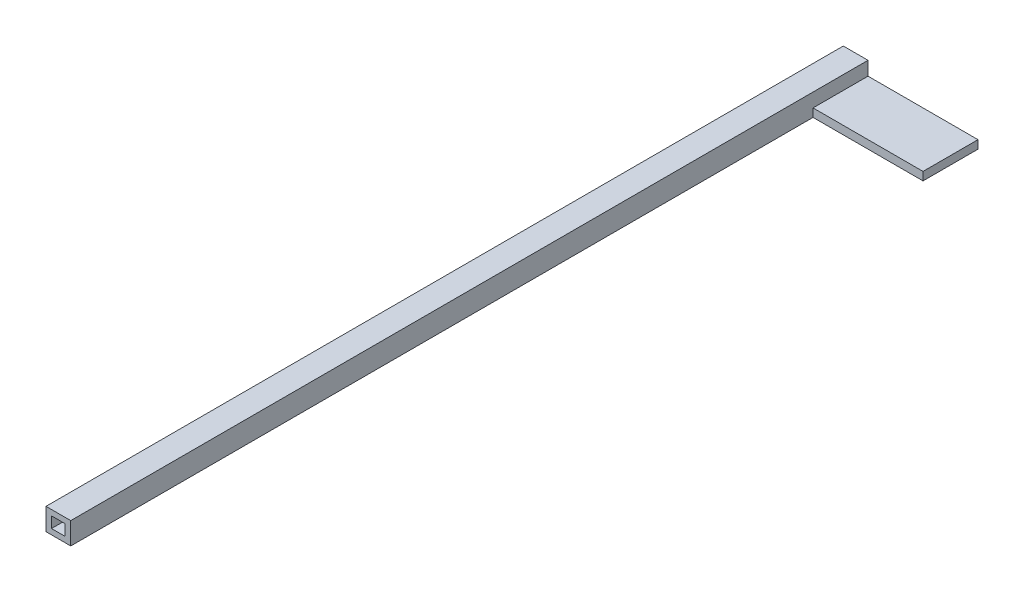
ISO-10303-21;
HEADER;
FILE_DESCRIPTION(('STEP AP214'),'2;1');
FILE_NAME('part.step','',(''),(''),'','','');
FILE_SCHEMA(('AUTOMOTIVE_DESIGN { 1 0 10303 214 1 1 1 1 }'));
ENDSEC;
DATA;
#1=APPLICATION_CONTEXT('core data for automotive mechanical design processes');
#2=APPLICATION_PROTOCOL_DEFINITION('international standard','automotive_design',2000,#1);
#3=PRODUCT_CONTEXT('',#1,'mechanical');
#4=PRODUCT('Part','Part','',(#3));
#5=PRODUCT_RELATED_PRODUCT_CATEGORY('part','',(#4));
#6=PRODUCT_DEFINITION_FORMATION('','',#4);
#7=PRODUCT_DEFINITION_CONTEXT('part definition',#1,'design');
#8=PRODUCT_DEFINITION('design','',#6,#7);
#9=PRODUCT_DEFINITION_SHAPE('','',#8);
#10=(LENGTH_UNIT() NAMED_UNIT(*) SI_UNIT(.MILLI.,.METRE.));
#11=(NAMED_UNIT(*) PLANE_ANGLE_UNIT() SI_UNIT($,.RADIAN.));
#12=(NAMED_UNIT(*) SI_UNIT($,.STERADIAN.) SOLID_ANGLE_UNIT());
#13=UNCERTAINTY_MEASURE_WITH_UNIT(LENGTH_MEASURE(1.E-05),#10,'distance_accuracy_value','');
#14=(GEOMETRIC_REPRESENTATION_CONTEXT(3) GLOBAL_UNCERTAINTY_ASSIGNED_CONTEXT((#13)) GLOBAL_UNIT_ASSIGNED_CONTEXT((#10,
#11,#12)) REPRESENTATION_CONTEXT('',''));
#15=CARTESIAN_POINT('',(0.,0.,0.));
#16=DIRECTION('',(0.,0.,1.));
#17=DIRECTION('',(1.,0.,0.));
#18=AXIS2_PLACEMENT_3D('',#15,#16,#17);
#19=CARTESIAN_POINT('',(0.,0.,290.));
#20=DIRECTION('',(0.,0.,1.));
#21=DIRECTION('',(1.,0.,0.));
#22=AXIS2_PLACEMENT_3D('',#19,#20,#21);
#23=PLANE('',#22);
#24=DIRECTION('',(0.,-1.,0.));
#25=VECTOR('',#24,1.);
#26=CARTESIAN_POINT('',(-4.5,-4.,290.));
#27=LINE('',#26,#25);
#28=CARTESIAN_POINT('',(-4.5,4.,290.));
#29=VERTEX_POINT('',#28);
#30=CARTESIAN_POINT('',(-4.5,-4.,290.));
#31=VERTEX_POINT('',#30);
#32=EDGE_CURVE('E168',#29,#31,#27,.T.);
#33=ORIENTED_EDGE('',*,*,#32,.T.);
#34=DIRECTION('',(1.,0.,0.));
#35=VECTOR('',#34,1.);
#36=CARTESIAN_POINT('',(4.5,-4.,290.));
#37=LINE('',#36,#35);
#38=CARTESIAN_POINT('',(4.5,-4.,290.));
#39=VERTEX_POINT('',#38);
#40=EDGE_CURVE('E171',#31,#39,#37,.T.);
#41=ORIENTED_EDGE('',*,*,#40,.T.);
#42=DIRECTION('',(0.,1.,0.));
#43=VECTOR('',#42,1.);
#44=CARTESIAN_POINT('',(4.5,-4.,290.));
#45=LINE('',#44,#43);
#46=CARTESIAN_POINT('',(4.5,4.,290.));
#47=VERTEX_POINT('',#46);
#48=EDGE_CURVE('E174',#39,#47,#45,.T.);
#49=ORIENTED_EDGE('',*,*,#48,.T.);
#50=DIRECTION('',(-1.,0.,0.));
#51=VECTOR('',#50,1.);
#52=CARTESIAN_POINT('',(4.5,4.,290.));
#53=LINE('',#52,#51);
#54=EDGE_CURVE('E176',#47,#29,#53,.T.);
#55=ORIENTED_EDGE('',*,*,#54,.T.);
#56=EDGE_LOOP('',(#33,#41,#49,#55));
#57=FACE_BOUND('',#56,.T.);
#58=DIRECTION('',(1.,0.,0.));
#59=VECTOR('',#58,1.);
#60=CARTESIAN_POINT('',(-2.5,-2.,290.));
#61=LINE('',#60,#59);
#62=CARTESIAN_POINT('',(-2.5,-2.,290.));
#63=VERTEX_POINT('',#62);
#64=CARTESIAN_POINT('',(2.5,-2.,290.));
#65=VERTEX_POINT('',#64);
#66=EDGE_CURVE('E132',#63,#65,#61,.T.);
#67=ORIENTED_EDGE('',*,*,#66,.F.);
#68=DIRECTION('',(0.,1.,0.));
#69=VECTOR('',#68,1.);
#70=CARTESIAN_POINT('',(-2.5,-2.,290.));
#71=LINE('',#70,#69);
#72=CARTESIAN_POINT('',(-2.5,2.,290.));
#73=VERTEX_POINT('',#72);
#74=EDGE_CURVE('E48',#63,#73,#71,.T.);
#75=ORIENTED_EDGE('',*,*,#74,.T.);
#76=DIRECTION('',(1.,0.,0.));
#77=VECTOR('',#76,1.);
#78=CARTESIAN_POINT('',(-2.5,2.,290.));
#79=LINE('',#78,#77);
#80=CARTESIAN_POINT('',(2.5,2.,290.));
#81=VERTEX_POINT('',#80);
#82=EDGE_CURVE('E136',#73,#81,#79,.T.);
#83=ORIENTED_EDGE('',*,*,#82,.T.);
#84=DIRECTION('',(0.,1.,0.));
#85=VECTOR('',#84,1.);
#86=CARTESIAN_POINT('',(2.5,-2.,290.));
#87=LINE('',#86,#85);
#88=EDGE_CURVE('E317',#65,#81,#87,.T.);
#89=ORIENTED_EDGE('',*,*,#88,.F.);
#90=EDGE_LOOP('',(#67,#75,#83,#89));
#91=FACE_BOUND('',#90,.T.);
#92=ADVANCED_FACE('F33',(#57,#91),#23,.T.);
#93=CARTESIAN_POINT('',(4.5,-4.,290.));
#94=DIRECTION('',(-1.,0.,0.));
#95=DIRECTION('',(0.,0.,1.));
#96=AXIS2_PLACEMENT_3D('',#93,#94,#95);
#97=PLANE('',#96);
#98=DIRECTION('',(0.,-1.,0.));
#99=VECTOR('',#98,1.);
#100=CARTESIAN_POINT('',(4.5,-4.,20.));
#101=LINE('',#100,#99);
#102=CARTESIAN_POINT('',(4.5,-1.,20.));
#103=VERTEX_POINT('',#102);
#104=CARTESIAN_POINT('',(4.5,-4.,20.));
#105=VERTEX_POINT('',#104);
#106=EDGE_CURVE('E141',#103,#105,#101,.T.);
#107=ORIENTED_EDGE('',*,*,#106,.F.);
#108=DIRECTION('',(0.,0.,1.));
#109=VECTOR('',#108,1.);
#110=CARTESIAN_POINT('',(4.5,-1.,0.));
#111=LINE('',#110,#109);
#112=CARTESIAN_POINT('',(4.5,-1.,0.));
#113=VERTEX_POINT('',#112);
#114=EDGE_CURVE('E137',#113,#103,#111,.T.);
#115=ORIENTED_EDGE('',*,*,#114,.F.);
#116=DIRECTION('',(0.,1.,0.));
#117=VECTOR('',#116,1.);
#118=CARTESIAN_POINT('',(4.5,-4.,0.));
#119=LINE('',#118,#117);
#120=CARTESIAN_POINT('',(4.5,4.,0.));
#121=VERTEX_POINT('',#120);
#122=EDGE_CURVE('E183',#113,#121,#119,.T.);
#123=ORIENTED_EDGE('',*,*,#122,.T.);
#124=DIRECTION('',(0.,0.,-1.));
#125=VECTOR('',#124,1.);
#126=CARTESIAN_POINT('',(4.5,4.,290.));
#127=LINE('',#126,#125);
#128=EDGE_CURVE('E188',#47,#121,#127,.T.);
#129=ORIENTED_EDGE('',*,*,#128,.F.);
#130=ORIENTED_EDGE('',*,*,#48,.F.);
#131=DIRECTION('',(0.,0.,-1.));
#132=VECTOR('',#131,1.);
#133=CARTESIAN_POINT('',(4.5,-4.,290.));
#134=LINE('',#133,#132);
#135=EDGE_CURVE('E41',#39,#105,#134,.T.);
#136=ORIENTED_EDGE('',*,*,#135,.T.);
#137=EDGE_LOOP('',(#107,#115,#123,#129,#130,#136));
#138=FACE_BOUND('',#137,.T.);
#139=ADVANCED_FACE('F207',(#138),#97,.F.);
#140=CARTESIAN_POINT('',(-4.5,-4.,290.));
#141=DIRECTION('',(1.,0.,0.));
#142=DIRECTION('',(0.,0.,-1.));
#143=AXIS2_PLACEMENT_3D('',#140,#141,#142);
#144=PLANE('',#143);
#145=DIRECTION('',(0.,-1.,0.));
#146=VECTOR('',#145,1.);
#147=CARTESIAN_POINT('',(-4.5,-4.,0.));
#148=LINE('',#147,#146);
#149=CARTESIAN_POINT('',(-4.5,4.,0.));
#150=VERTEX_POINT('',#149);
#151=CARTESIAN_POINT('',(-4.5,-4.,0.));
#152=VERTEX_POINT('',#151);
#153=EDGE_CURVE('E167',#150,#152,#148,.T.);
#154=ORIENTED_EDGE('',*,*,#153,.T.);
#155=DIRECTION('',(0.,0.,-1.));
#156=VECTOR('',#155,1.);
#157=CARTESIAN_POINT('',(-4.5,-4.,290.));
#158=LINE('',#157,#156);
#159=EDGE_CURVE('E11',#31,#152,#158,.T.);
#160=ORIENTED_EDGE('',*,*,#159,.F.);
#161=ORIENTED_EDGE('',*,*,#32,.F.);
#162=DIRECTION('',(0.,0.,-1.));
#163=VECTOR('',#162,1.);
#164=CARTESIAN_POINT('',(-4.5,4.,290.));
#165=LINE('',#164,#163);
#166=EDGE_CURVE('E178',#29,#150,#165,.T.);
#167=ORIENTED_EDGE('',*,*,#166,.T.);
#168=EDGE_LOOP('',(#154,#160,#161,#167));
#169=FACE_BOUND('',#168,.T.);
#170=ADVANCED_FACE('F35',(#169),#144,.F.);
#171=CARTESIAN_POINT('',(4.5,-4.,290.));
#172=DIRECTION('',(0.,1.,0.));
#173=DIRECTION('',(-1.,0.,0.));
#174=AXIS2_PLACEMENT_3D('',#171,#172,#173);
#175=PLANE('',#174);
#176=DIRECTION('',(1.,0.,0.));
#177=VECTOR('',#176,1.);
#178=CARTESIAN_POINT('',(4.5,-4.,0.));
#179=LINE('',#178,#177);
#180=CARTESIAN_POINT('',(44.5,-4.,0.));
#181=VERTEX_POINT('',#180);
#182=EDGE_CURVE('E181',#152,#181,#179,.T.);
#183=ORIENTED_EDGE('',*,*,#182,.T.);
#184=DIRECTION('',(0.,0.,-1.));
#185=VECTOR('',#184,1.);
#186=CARTESIAN_POINT('',(44.5,-4.,0.));
#187=LINE('',#186,#185);
#188=CARTESIAN_POINT('',(44.5,-4.,20.));
#189=VERTEX_POINT('',#188);
#190=EDGE_CURVE('E154',#189,#181,#187,.T.);
#191=ORIENTED_EDGE('',*,*,#190,.F.);
#192=DIRECTION('',(-1.,0.,0.));
#193=VECTOR('',#192,1.);
#194=CARTESIAN_POINT('',(44.5,-4.,20.));
#195=LINE('',#194,#193);
#196=EDGE_CURVE('E156',#189,#105,#195,.T.);
#197=ORIENTED_EDGE('',*,*,#196,.T.);
#198=ORIENTED_EDGE('',*,*,#135,.F.);
#199=ORIENTED_EDGE('',*,*,#40,.F.);
#200=ORIENTED_EDGE('',*,*,#159,.T.);
#201=EDGE_LOOP('',(#183,#191,#197,#198,#199,#200));
#202=FACE_BOUND('',#201,.T.);
#203=ADVANCED_FACE('F214',(#202),#175,.F.);
#204=CARTESIAN_POINT('',(4.5,4.,290.));
#205=DIRECTION('',(0.,-1.,0.));
#206=DIRECTION('',(1.,0.,0.));
#207=AXIS2_PLACEMENT_3D('',#204,#205,#206);
#208=PLANE('',#207);
#209=DIRECTION('',(-1.,0.,0.));
#210=VECTOR('',#209,1.);
#211=CARTESIAN_POINT('',(4.5,4.,0.));
#212=LINE('',#211,#210);
#213=EDGE_CURVE('E172',#121,#150,#212,.T.);
#214=ORIENTED_EDGE('',*,*,#213,.T.);
#215=ORIENTED_EDGE('',*,*,#166,.F.);
#216=ORIENTED_EDGE('',*,*,#54,.F.);
#217=ORIENTED_EDGE('',*,*,#128,.T.);
#218=EDGE_LOOP('',(#214,#215,#216,#217));
#219=FACE_BOUND('',#218,.T.);
#220=ADVANCED_FACE('F194',(#219),#208,.F.);
#221=CARTESIAN_POINT('',(0.,0.,0.));
#222=DIRECTION('',(0.,0.,1.));
#223=DIRECTION('',(1.,0.,0.));
#224=AXIS2_PLACEMENT_3D('',#221,#222,#223);
#225=PLANE('',#224);
#226=ORIENTED_EDGE('',*,*,#153,.F.);
#227=ORIENTED_EDGE('',*,*,#213,.F.);
#228=ORIENTED_EDGE('',*,*,#122,.F.);
#229=DIRECTION('',(-1.,0.,0.));
#230=VECTOR('',#229,1.);
#231=CARTESIAN_POINT('',(44.5,-0.999999999999997,0.));
#232=LINE('',#231,#230);
#233=CARTESIAN_POINT('',(44.5,-0.999999999999997,0.));
#234=VERTEX_POINT('',#233);
#235=EDGE_CURVE('E164',#234,#113,#232,.T.);
#236=ORIENTED_EDGE('',*,*,#235,.F.);
#237=DIRECTION('',(0.,1.,0.));
#238=VECTOR('',#237,1.);
#239=CARTESIAN_POINT('',(44.5,-4.,0.));
#240=LINE('',#239,#238);
#241=EDGE_CURVE('E147',#181,#234,#240,.T.);
#242=ORIENTED_EDGE('',*,*,#241,.F.);
#243=ORIENTED_EDGE('',*,*,#182,.F.);
#244=EDGE_LOOP('',(#226,#227,#228,#236,#242,#243));
#245=FACE_BOUND('',#244,.T.);
#246=ADVANCED_FACE('F199',(#245),#225,.F.);
#247=CARTESIAN_POINT('',(44.5,-0.999999999999997,0.));
#248=DIRECTION('',(0.,-1.,0.));
#249=DIRECTION('',(0.,0.,-1.));
#250=AXIS2_PLACEMENT_3D('',#247,#248,#249);
#251=PLANE('',#250);
#252=ORIENTED_EDGE('',*,*,#114,.T.);
#253=DIRECTION('',(-1.,0.,0.));
#254=VECTOR('',#253,1.);
#255=CARTESIAN_POINT('',(44.5,-0.999999999999999,20.));
#256=LINE('',#255,#254);
#257=CARTESIAN_POINT('',(44.5,-0.999999999999999,20.));
#258=VERTEX_POINT('',#257);
#259=EDGE_CURVE('E161',#258,#103,#256,.T.);
#260=ORIENTED_EDGE('',*,*,#259,.F.);
#261=DIRECTION('',(0.,0.,1.));
#262=VECTOR('',#261,1.);
#263=CARTESIAN_POINT('',(44.5,-0.999999999999997,0.));
#264=LINE('',#263,#262);
#265=EDGE_CURVE('E150',#234,#258,#264,.T.);
#266=ORIENTED_EDGE('',*,*,#265,.F.);
#267=ORIENTED_EDGE('',*,*,#235,.T.);
#268=EDGE_LOOP('',(#252,#260,#266,#267));
#269=FACE_BOUND('',#268,.T.);
#270=ADVANCED_FACE('F229',(#269),#251,.F.);
#271=CARTESIAN_POINT('',(44.5,-4.,20.));
#272=DIRECTION('',(0.,0.,-1.));
#273=DIRECTION('',(-1.,0.,0.));
#274=AXIS2_PLACEMENT_3D('',#271,#272,#273);
#275=PLANE('',#274);
#276=ORIENTED_EDGE('',*,*,#106,.T.);
#277=ORIENTED_EDGE('',*,*,#196,.F.);
#278=DIRECTION('',(0.,-1.,0.));
#279=VECTOR('',#278,1.);
#280=CARTESIAN_POINT('',(44.5,-4.,20.));
#281=LINE('',#280,#279);
#282=EDGE_CURVE('E152',#258,#189,#281,.T.);
#283=ORIENTED_EDGE('',*,*,#282,.F.);
#284=ORIENTED_EDGE('',*,*,#259,.T.);
#285=EDGE_LOOP('',(#276,#277,#283,#284));
#286=FACE_BOUND('',#285,.T.);
#287=ADVANCED_FACE('F232',(#286),#275,.F.);
#288=CARTESIAN_POINT('',(44.5,0.,0.));
#289=DIRECTION('',(1.,0.,0.));
#290=DIRECTION('',(0.,0.,-1.));
#291=AXIS2_PLACEMENT_3D('',#288,#289,#290);
#292=PLANE('',#291);
#293=ORIENTED_EDGE('',*,*,#241,.T.);
#294=ORIENTED_EDGE('',*,*,#265,.T.);
#295=ORIENTED_EDGE('',*,*,#282,.T.);
#296=ORIENTED_EDGE('',*,*,#190,.T.);
#297=EDGE_LOOP('',(#293,#294,#295,#296));
#298=FACE_BOUND('',#297,.T.);
#299=ADVANCED_FACE('F225',(#298),#292,.T.);
#300=CARTESIAN_POINT('',(-2.5,-2.,270.));
#301=DIRECTION('',(1.,0.,0.));
#302=DIRECTION('',(0.,1.,0.));
#303=AXIS2_PLACEMENT_3D('',#300,#301,#302);
#304=PLANE('',#303);
#305=ORIENTED_EDGE('',*,*,#74,.F.);
#306=DIRECTION('',(0.,0.,1.));
#307=VECTOR('',#306,1.);
#308=CARTESIAN_POINT('',(-2.5,-2.,270.));
#309=LINE('',#308,#307);
#310=CARTESIAN_POINT('',(-2.5,-2.,270.));
#311=VERTEX_POINT('',#310);
#312=EDGE_CURVE('E131',#311,#63,#309,.T.);
#313=ORIENTED_EDGE('',*,*,#312,.F.);
#314=DIRECTION('',(0.,1.,0.));
#315=VECTOR('',#314,1.);
#316=CARTESIAN_POINT('',(-2.5,-2.,270.));
#317=LINE('',#316,#315);
#318=CARTESIAN_POINT('',(-2.5,2.,270.));
#319=VERTEX_POINT('',#318);
#320=EDGE_CURVE('E121',#311,#319,#317,.T.);
#321=ORIENTED_EDGE('',*,*,#320,.T.);
#322=DIRECTION('',(0.,0.,1.));
#323=VECTOR('',#322,1.);
#324=CARTESIAN_POINT('',(-2.5,2.,270.));
#325=LINE('',#324,#323);
#326=EDGE_CURVE('E130',#319,#73,#325,.T.);
#327=ORIENTED_EDGE('',*,*,#326,.T.);
#328=EDGE_LOOP('',(#305,#313,#321,#327));
#329=FACE_BOUND('',#328,.T.);
#330=ADVANCED_FACE('F129',(#329),#304,.T.);
#331=CARTESIAN_POINT('',(-2.5,2.,270.));
#332=DIRECTION('',(0.,-1.,0.));
#333=DIRECTION('',(0.,0.,-1.));
#334=AXIS2_PLACEMENT_3D('',#331,#332,#333);
#335=PLANE('',#334);
#336=ORIENTED_EDGE('',*,*,#82,.F.);
#337=ORIENTED_EDGE('',*,*,#326,.F.);
#338=DIRECTION('',(1.,0.,0.));
#339=VECTOR('',#338,1.);
#340=CARTESIAN_POINT('',(-2.5,2.,270.));
#341=LINE('',#340,#339);
#342=CARTESIAN_POINT('',(2.5,2.,270.));
#343=VERTEX_POINT('',#342);
#344=EDGE_CURVE('E117',#319,#343,#341,.T.);
#345=ORIENTED_EDGE('',*,*,#344,.T.);
#346=DIRECTION('',(0.,0.,1.));
#347=VECTOR('',#346,1.);
#348=CARTESIAN_POINT('',(2.5,2.,270.));
#349=LINE('',#348,#347);
#350=EDGE_CURVE('E138',#343,#81,#349,.T.);
#351=ORIENTED_EDGE('',*,*,#350,.T.);
#352=EDGE_LOOP('',(#336,#337,#345,#351));
#353=FACE_BOUND('',#352,.T.);
#354=ADVANCED_FACE('F134',(#353),#335,.T.);
#355=CARTESIAN_POINT('',(2.5,-2.,270.));
#356=DIRECTION('',(1.,0.,0.));
#357=DIRECTION('',(0.,0.,-1.));
#358=AXIS2_PLACEMENT_3D('',#355,#356,#357);
#359=PLANE('',#358);
#360=ORIENTED_EDGE('',*,*,#88,.T.);
#361=ORIENTED_EDGE('',*,*,#350,.F.);
#362=DIRECTION('',(0.,1.,0.));
#363=VECTOR('',#362,1.);
#364=CARTESIAN_POINT('',(2.5,-2.,270.));
#365=LINE('',#364,#363);
#366=CARTESIAN_POINT('',(2.5,-2.,270.));
#367=VERTEX_POINT('',#366);
#368=EDGE_CURVE('E124',#367,#343,#365,.T.);
#369=ORIENTED_EDGE('',*,*,#368,.F.);
#370=DIRECTION('',(0.,0.,1.));
#371=VECTOR('',#370,1.);
#372=CARTESIAN_POINT('',(2.5,-2.,270.));
#373=LINE('',#372,#371);
#374=EDGE_CURVE('E143',#367,#65,#373,.T.);
#375=ORIENTED_EDGE('',*,*,#374,.T.);
#376=EDGE_LOOP('',(#360,#361,#369,#375));
#377=FACE_BOUND('',#376,.T.);
#378=ADVANCED_FACE('F283',(#377),#359,.F.);
#379=CARTESIAN_POINT('',(-2.5,-2.,270.));
#380=DIRECTION('',(0.,-1.,0.));
#381=DIRECTION('',(1.,0.,0.));
#382=AXIS2_PLACEMENT_3D('',#379,#380,#381);
#383=PLANE('',#382);
#384=ORIENTED_EDGE('',*,*,#66,.T.);
#385=ORIENTED_EDGE('',*,*,#374,.F.);
#386=DIRECTION('',(1.,0.,0.));
#387=VECTOR('',#386,1.);
#388=CARTESIAN_POINT('',(-2.5,-2.,270.));
#389=LINE('',#388,#387);
#390=EDGE_CURVE('E324',#311,#367,#389,.T.);
#391=ORIENTED_EDGE('',*,*,#390,.F.);
#392=ORIENTED_EDGE('',*,*,#312,.T.);
#393=EDGE_LOOP('',(#384,#385,#391,#392));
#394=FACE_BOUND('',#393,.T.);
#395=ADVANCED_FACE('F292',(#394),#383,.F.);
#396=CARTESIAN_POINT('',(0.,0.,270.));
#397=DIRECTION('',(0.,0.,-1.));
#398=DIRECTION('',(-1.,0.,0.));
#399=AXIS2_PLACEMENT_3D('',#396,#397,#398);
#400=PLANE('',#399);
#401=ORIENTED_EDGE('',*,*,#320,.F.);
#402=ORIENTED_EDGE('',*,*,#390,.T.);
#403=ORIENTED_EDGE('',*,*,#368,.T.);
#404=ORIENTED_EDGE('',*,*,#344,.F.);
#405=EDGE_LOOP('',(#401,#402,#403,#404));
#406=FACE_BOUND('',#405,.T.);
#407=ADVANCED_FACE('F119',(#406),#400,.F.);
#408=CLOSED_SHELL('',(#92,#139,#170,#203,#220,#246,#270,#287,#299,#330,#354,#378,#395,#407));
#409=MANIFOLD_SOLID_BREP('B2',#408);
#410=ADVANCED_BREP_SHAPE_REPRESENTATION('',(#18,#409),#14);
#411=SHAPE_DEFINITION_REPRESENTATION(#9,#410);
ENDSEC;
END-ISO-10303-21;
